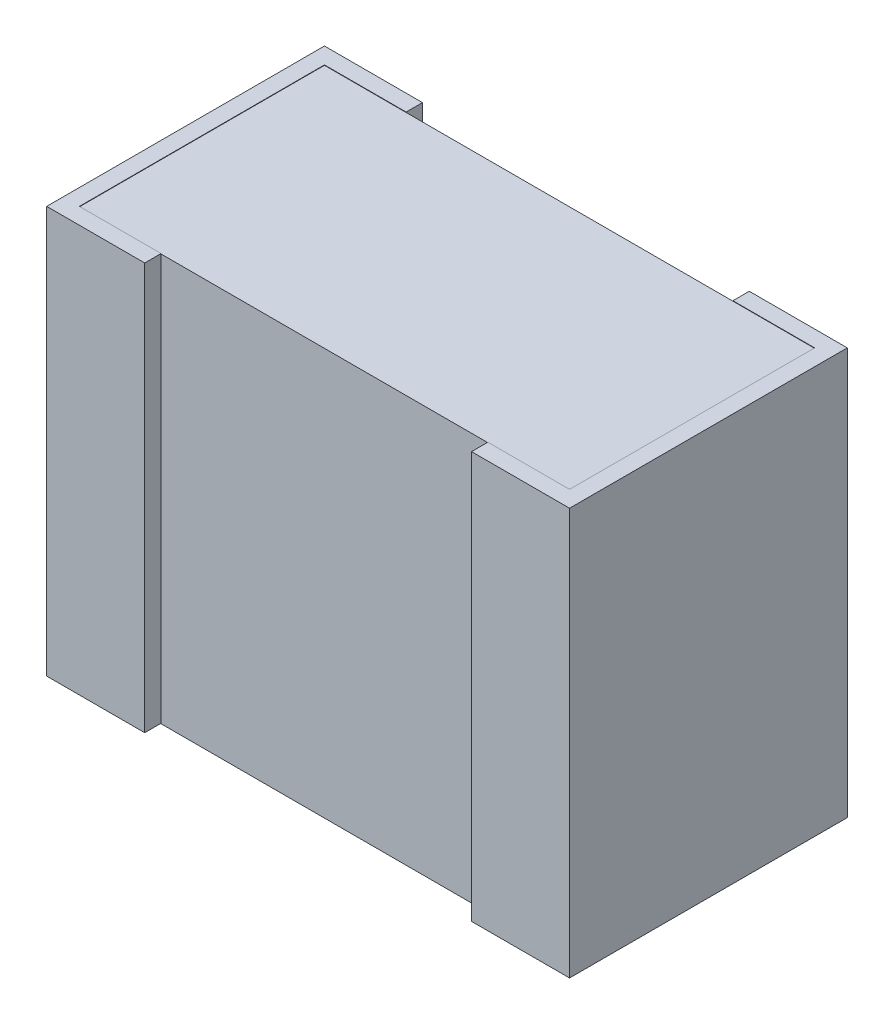
ISO-10303-21;
HEADER;
FILE_DESCRIPTION(('STEP AP214'),'2;1');
FILE_NAME('part.step','',(''),(''),'','','');
FILE_SCHEMA(('AUTOMOTIVE_DESIGN { 1 0 10303 214 1 1 1 1 }'));
ENDSEC;
DATA;
#1=APPLICATION_CONTEXT('core data for automotive mechanical design processes');
#2=APPLICATION_PROTOCOL_DEFINITION('international standard','automotive_design',2000,#1);
#3=PRODUCT_CONTEXT('',#1,'mechanical');
#4=PRODUCT('Part','Part','',(#3));
#5=PRODUCT_RELATED_PRODUCT_CATEGORY('part','',(#4));
#6=PRODUCT_DEFINITION_FORMATION('','',#4);
#7=PRODUCT_DEFINITION_CONTEXT('part definition',#1,'design');
#8=PRODUCT_DEFINITION('design','',#6,#7);
#9=PRODUCT_DEFINITION_SHAPE('','',#8);
#10=(LENGTH_UNIT() NAMED_UNIT(*) SI_UNIT(.MILLI.,.METRE.));
#11=(NAMED_UNIT(*) PLANE_ANGLE_UNIT() SI_UNIT($,.RADIAN.));
#12=(NAMED_UNIT(*) SI_UNIT($,.STERADIAN.) SOLID_ANGLE_UNIT());
#13=UNCERTAINTY_MEASURE_WITH_UNIT(LENGTH_MEASURE(1.E-05),#10,'distance_accuracy_value','');
#14=(GEOMETRIC_REPRESENTATION_CONTEXT(3) GLOBAL_UNCERTAINTY_ASSIGNED_CONTEXT((#13)) GLOBAL_UNIT_ASSIGNED_CONTEXT((#10,
#11,#12)) REPRESENTATION_CONTEXT('',''));
#15=CARTESIAN_POINT('',(0.,0.,0.));
#16=DIRECTION('',(0.,0.,1.));
#17=DIRECTION('',(1.,0.,0.));
#18=AXIS2_PLACEMENT_3D('',#15,#16,#17);
#19=CARTESIAN_POINT('',(-1.5,1.245,0.75));
#20=DIRECTION('',(0.,0.,-1.));
#21=DIRECTION('',(-1.,0.,0.));
#22=AXIS2_PLACEMENT_3D('',#19,#20,#21);
#23=PLANE('',#22);
#24=DIRECTION('',(0.,1.,0.));
#25=VECTOR('',#24,1.);
#26=CARTESIAN_POINT('',(1.,-1.24246,0.75));
#27=LINE('',#26,#25);
#28=CARTESIAN_POINT('',(1.,-1.24246,0.75));
#29=VERTEX_POINT('',#28);
#30=CARTESIAN_POINT('',(1.,1.245,0.75));
#31=VERTEX_POINT('',#30);
#32=EDGE_CURVE('E315',#29,#31,#27,.T.);
#33=ORIENTED_EDGE('',*,*,#32,.T.);
#34=DIRECTION('',(1.,0.,0.));
#35=VECTOR('',#34,1.);
#36=CARTESIAN_POINT('',(-1.5,1.245,0.75));
#37=LINE('',#36,#35);
#38=CARTESIAN_POINT('',(-1.,1.245,0.75));
#39=VERTEX_POINT('',#38);
#40=EDGE_CURVE('E224',#39,#31,#37,.T.);
#41=ORIENTED_EDGE('',*,*,#40,.F.);
#42=DIRECTION('',(0.,1.,0.));
#43=VECTOR('',#42,1.);
#44=CARTESIAN_POINT('',(-1.,-1.24246,0.75));
#45=LINE('',#44,#43);
#46=CARTESIAN_POINT('',(-1.,-1.24246,0.75));
#47=VERTEX_POINT('',#46);
#48=EDGE_CURVE('E61',#47,#39,#45,.T.);
#49=ORIENTED_EDGE('',*,*,#48,.F.);
#50=DIRECTION('',(1.,0.,0.));
#51=VECTOR('',#50,1.);
#52=CARTESIAN_POINT('',(-1.5,-1.24246,0.75));
#53=LINE('',#52,#51);
#54=CARTESIAN_POINT('',(-1.5,-1.24246,0.75));
#55=VERTEX_POINT('',#54);
#56=EDGE_CURVE('E257',#55,#47,#53,.T.);
#57=ORIENTED_EDGE('',*,*,#56,.F.);
#58=DIRECTION('',(0.,-1.,0.));
#59=VECTOR('',#58,1.);
#60=CARTESIAN_POINT('',(-1.5,1.245,0.75));
#61=LINE('',#60,#59);
#62=CARTESIAN_POINT('',(-1.5,-1.245,0.75));
#63=VERTEX_POINT('',#62);
#64=EDGE_CURVE('E11',#55,#63,#61,.T.);
#65=ORIENTED_EDGE('',*,*,#64,.T.);
#66=DIRECTION('',(1.,0.,0.));
#67=VECTOR('',#66,1.);
#68=CARTESIAN_POINT('',(-1.5,-1.245,0.75));
#69=LINE('',#68,#67);
#70=CARTESIAN_POINT('',(1.5,-1.245,0.75));
#71=VERTEX_POINT('',#70);
#72=EDGE_CURVE('E207',#63,#71,#69,.T.);
#73=ORIENTED_EDGE('',*,*,#72,.T.);
#74=DIRECTION('',(0.,-1.,0.));
#75=VECTOR('',#74,1.);
#76=CARTESIAN_POINT('',(1.5,1.245,0.75));
#77=LINE('',#76,#75);
#78=CARTESIAN_POINT('',(1.5,-1.24246,0.75));
#79=VERTEX_POINT('',#78);
#80=EDGE_CURVE('E45',#79,#71,#77,.T.);
#81=ORIENTED_EDGE('',*,*,#80,.F.);
#82=DIRECTION('',(-1.,0.,0.));
#83=VECTOR('',#82,1.);
#84=CARTESIAN_POINT('',(1.5,-1.24246,0.75));
#85=LINE('',#84,#83);
#86=EDGE_CURVE('E185',#79,#29,#85,.T.);
#87=ORIENTED_EDGE('',*,*,#86,.T.);
#88=EDGE_LOOP('',(#33,#41,#49,#57,#65,#73,#81,#87));
#89=FACE_BOUND('',#88,.T.);
#90=ADVANCED_FACE('F36',(#89),#23,.F.);
#91=CARTESIAN_POINT('',(1.5,1.245,-0.75));
#92=DIRECTION('',(1.,0.,0.));
#93=DIRECTION('',(0.,0.,-1.));
#94=AXIS2_PLACEMENT_3D('',#91,#92,#93);
#95=PLANE('',#94);
#96=DIRECTION('',(0.,-1.,0.));
#97=VECTOR('',#96,1.);
#98=CARTESIAN_POINT('',(1.5,1.245,-0.75));
#99=LINE('',#98,#97);
#100=CARTESIAN_POINT('',(1.5,-1.24246,-0.75));
#101=VERTEX_POINT('',#100);
#102=CARTESIAN_POINT('',(1.5,-1.245,-0.75));
#103=VERTEX_POINT('',#102);
#104=EDGE_CURVE('E203',#101,#103,#99,.T.);
#105=ORIENTED_EDGE('',*,*,#104,.F.);
#106=DIRECTION('',(0.,0.,1.));
#107=VECTOR('',#106,1.);
#108=CARTESIAN_POINT('',(1.5,-1.24246,-0.75));
#109=LINE('',#108,#107);
#110=EDGE_CURVE('E189',#101,#79,#109,.T.);
#111=ORIENTED_EDGE('',*,*,#110,.T.);
#112=ORIENTED_EDGE('',*,*,#80,.T.);
#113=DIRECTION('',(0.,0.,1.));
#114=VECTOR('',#113,1.);
#115=CARTESIAN_POINT('',(1.5,-1.245,-0.75));
#116=LINE('',#115,#114);
#117=EDGE_CURVE('E213',#103,#71,#116,.T.);
#118=ORIENTED_EDGE('',*,*,#117,.F.);
#119=EDGE_LOOP('',(#105,#111,#112,#118));
#120=FACE_BOUND('',#119,.T.);
#121=ADVANCED_FACE('F200',(#120),#95,.T.);
#122=CARTESIAN_POINT('',(1.5,1.245,-0.75));
#123=DIRECTION('',(0.,0.,1.));
#124=DIRECTION('',(1.,0.,0.));
#125=AXIS2_PLACEMENT_3D('',#122,#123,#124);
#126=PLANE('',#125);
#127=DIRECTION('',(0.,1.,0.));
#128=VECTOR('',#127,1.);
#129=CARTESIAN_POINT('',(1.,-1.24246,-0.75));
#130=LINE('',#129,#128);
#131=CARTESIAN_POINT('',(1.,-1.24246,-0.75));
#132=VERTEX_POINT('',#131);
#133=CARTESIAN_POINT('',(1.,1.245,-0.75));
#134=VERTEX_POINT('',#133);
#135=EDGE_CURVE('E53',#132,#134,#130,.T.);
#136=ORIENTED_EDGE('',*,*,#135,.F.);
#137=DIRECTION('',(1.,0.,0.));
#138=VECTOR('',#137,1.);
#139=CARTESIAN_POINT('',(1.,-1.24246,-0.75));
#140=LINE('',#139,#138);
#141=EDGE_CURVE('E204',#132,#101,#140,.T.);
#142=ORIENTED_EDGE('',*,*,#141,.T.);
#143=ORIENTED_EDGE('',*,*,#104,.T.);
#144=DIRECTION('',(-1.,0.,0.));
#145=VECTOR('',#144,1.);
#146=CARTESIAN_POINT('',(1.5,-1.245,-0.75));
#147=LINE('',#146,#145);
#148=CARTESIAN_POINT('',(-1.5,-1.245,-0.75));
#149=VERTEX_POINT('',#148);
#150=EDGE_CURVE('E215',#103,#149,#147,.T.);
#151=ORIENTED_EDGE('',*,*,#150,.T.);
#152=DIRECTION('',(0.,-1.,0.));
#153=VECTOR('',#152,1.);
#154=CARTESIAN_POINT('',(-1.5,1.245,-0.75));
#155=LINE('',#154,#153);
#156=CARTESIAN_POINT('',(-1.5,-1.24246,-0.75));
#157=VERTEX_POINT('',#156);
#158=EDGE_CURVE('E40',#157,#149,#155,.T.);
#159=ORIENTED_EDGE('',*,*,#158,.F.);
#160=DIRECTION('',(-1.,0.,0.));
#161=VECTOR('',#160,1.);
#162=CARTESIAN_POINT('',(-1.,-1.24246,-0.75));
#163=LINE('',#162,#161);
#164=CARTESIAN_POINT('',(-1.,-1.24246,-0.75));
#165=VERTEX_POINT('',#164);
#166=EDGE_CURVE('E282',#165,#157,#163,.T.);
#167=ORIENTED_EDGE('',*,*,#166,.F.);
#168=DIRECTION('',(0.,1.,0.));
#169=VECTOR('',#168,1.);
#170=CARTESIAN_POINT('',(-1.,-1.24246,-0.75));
#171=LINE('',#170,#169);
#172=CARTESIAN_POINT('',(-1.,1.245,-0.75));
#173=VERTEX_POINT('',#172);
#174=EDGE_CURVE('E245',#165,#173,#171,.T.);
#175=ORIENTED_EDGE('',*,*,#174,.T.);
#176=DIRECTION('',(-1.,0.,0.));
#177=VECTOR('',#176,1.);
#178=CARTESIAN_POINT('',(1.5,1.245,-0.75));
#179=LINE('',#178,#177);
#180=EDGE_CURVE('E231',#134,#173,#179,.T.);
#181=ORIENTED_EDGE('',*,*,#180,.F.);
#182=EDGE_LOOP('',(#136,#142,#143,#151,#159,#167,#175,#181));
#183=FACE_BOUND('',#182,.T.);
#184=ADVANCED_FACE('F350',(#183),#126,.F.);
#185=CARTESIAN_POINT('',(-1.5,1.245,0.75));
#186=DIRECTION('',(-1.,0.,0.));
#187=DIRECTION('',(0.,0.,1.));
#188=AXIS2_PLACEMENT_3D('',#185,#186,#187);
#189=PLANE('',#188);
#190=ORIENTED_EDGE('',*,*,#64,.F.);
#191=DIRECTION('',(0.,0.,1.));
#192=VECTOR('',#191,1.);
#193=CARTESIAN_POINT('',(-1.5,-1.24246,-0.75));
#194=LINE('',#193,#192);
#195=EDGE_CURVE('E253',#157,#55,#194,.T.);
#196=ORIENTED_EDGE('',*,*,#195,.F.);
#197=ORIENTED_EDGE('',*,*,#158,.T.);
#198=DIRECTION('',(0.,0.,-1.));
#199=VECTOR('',#198,1.);
#200=CARTESIAN_POINT('',(-1.5,-1.245,0.75));
#201=LINE('',#200,#199);
#202=EDGE_CURVE('E218',#63,#149,#201,.T.);
#203=ORIENTED_EDGE('',*,*,#202,.F.);
#204=EDGE_LOOP('',(#190,#196,#197,#203));
#205=FACE_BOUND('',#204,.T.);
#206=ADVANCED_FACE('F38',(#205),#189,.T.);
#207=CARTESIAN_POINT('',(-1.5,1.245,0.75));
#208=DIRECTION('',(0.,-1.,0.));
#209=DIRECTION('',(0.,0.,-1.));
#210=AXIS2_PLACEMENT_3D('',#207,#208,#209);
#211=PLANE('',#210);
#212=DIRECTION('',(0.,0.,-1.));
#213=VECTOR('',#212,1.);
#214=CARTESIAN_POINT('',(-1.5,1.245,0.75));
#215=LINE('',#214,#213);
#216=CARTESIAN_POINT('',(-1.5,1.245,0.75));
#217=VERTEX_POINT('',#216);
#218=CARTESIAN_POINT('',(-1.5,1.245,-0.75));
#219=VERTEX_POINT('',#218);
#220=EDGE_CURVE('E212',#217,#219,#215,.T.);
#221=ORIENTED_EDGE('',*,*,#220,.F.);
#222=EDGE_CURVE('E221',#217,#39,#37,.T.);
#223=ORIENTED_EDGE('',*,*,#222,.T.);
#224=ORIENTED_EDGE('',*,*,#40,.T.);
#225=CARTESIAN_POINT('',(1.5,1.245,0.75));
#226=VERTEX_POINT('',#225);
#227=EDGE_CURVE('E225',#31,#226,#37,.T.);
#228=ORIENTED_EDGE('',*,*,#227,.T.);
#229=DIRECTION('',(0.,0.,1.));
#230=VECTOR('',#229,1.);
#231=CARTESIAN_POINT('',(1.5,1.245,-0.75));
#232=LINE('',#231,#230);
#233=CARTESIAN_POINT('',(1.5,1.245,-0.75));
#234=VERTEX_POINT('',#233);
#235=EDGE_CURVE('E226',#234,#226,#232,.T.);
#236=ORIENTED_EDGE('',*,*,#235,.F.);
#237=EDGE_CURVE('E228',#234,#134,#179,.T.);
#238=ORIENTED_EDGE('',*,*,#237,.T.);
#239=ORIENTED_EDGE('',*,*,#180,.T.);
#240=EDGE_CURVE('E232',#173,#219,#179,.T.);
#241=ORIENTED_EDGE('',*,*,#240,.T.);
#242=EDGE_LOOP('',(#221,#223,#224,#228,#236,#238,#239,#241));
#243=FACE_BOUND('',#242,.T.);
#244=ADVANCED_FACE('F377',(#243),#211,.F.);
#245=CARTESIAN_POINT('',(-1.5,-1.245,0.75));
#246=DIRECTION('',(0.,-1.,0.));
#247=DIRECTION('',(0.,0.,-1.));
#248=AXIS2_PLACEMENT_3D('',#245,#246,#247);
#249=PLANE('',#248);
#250=ORIENTED_EDGE('',*,*,#202,.T.);
#251=ORIENTED_EDGE('',*,*,#150,.F.);
#252=ORIENTED_EDGE('',*,*,#117,.T.);
#253=ORIENTED_EDGE('',*,*,#72,.F.);
#254=EDGE_LOOP('',(#250,#251,#252,#253));
#255=FACE_BOUND('',#254,.T.);
#256=ADVANCED_FACE('F446',(#255),#249,.T.);
#257=CARTESIAN_POINT('',(-1.5,-1.24246,0.75));
#258=DIRECTION('',(0.,0.,1.));
#259=DIRECTION('',(1.,0.,0.));
#260=AXIS2_PLACEMENT_3D('',#257,#258,#259);
#261=PLANE('',#260);
#262=CARTESIAN_POINT('',(-1.,1.24754,0.75));
#263=VERTEX_POINT('',#262);
#264=EDGE_CURVE('E236',#39,#263,#45,.T.);
#265=ORIENTED_EDGE('',*,*,#264,.F.);
#266=ORIENTED_EDGE('',*,*,#222,.F.);
#267=DIRECTION('',(0.,1.,0.));
#268=VECTOR('',#267,1.);
#269=CARTESIAN_POINT('',(-1.5,-1.24246,0.75));
#270=LINE('',#269,#268);
#271=CARTESIAN_POINT('',(-1.5,1.24754,0.75));
#272=VERTEX_POINT('',#271);
#273=EDGE_CURVE('E251',#217,#272,#270,.T.);
#274=ORIENTED_EDGE('',*,*,#273,.T.);
#275=DIRECTION('',(1.,0.,0.));
#276=VECTOR('',#275,1.);
#277=CARTESIAN_POINT('',(-1.5,1.24754,0.75));
#278=LINE('',#277,#276);
#279=EDGE_CURVE('E276',#272,#263,#278,.T.);
#280=ORIENTED_EDGE('',*,*,#279,.T.);
#281=EDGE_LOOP('',(#265,#266,#274,#280));
#282=FACE_BOUND('',#281,.T.);
#283=ADVANCED_FACE('F383',(#282),#261,.F.);
#284=CARTESIAN_POINT('',(-1.,-1.24246,-0.75));
#285=DIRECTION('',(0.,0.,-1.));
#286=DIRECTION('',(-1.,0.,0.));
#287=AXIS2_PLACEMENT_3D('',#284,#285,#286);
#288=PLANE('',#287);
#289=DIRECTION('',(0.,1.,0.));
#290=VECTOR('',#289,1.);
#291=CARTESIAN_POINT('',(-1.5,-1.24246,-0.75));
#292=LINE('',#291,#290);
#293=CARTESIAN_POINT('',(-1.5,1.24754,-0.75));
#294=VERTEX_POINT('',#293);
#295=EDGE_CURVE('E249',#219,#294,#292,.T.);
#296=ORIENTED_EDGE('',*,*,#295,.F.);
#297=ORIENTED_EDGE('',*,*,#240,.F.);
#298=CARTESIAN_POINT('',(-1.,1.24754,-0.75));
#299=VERTEX_POINT('',#298);
#300=EDGE_CURVE('E248',#173,#299,#171,.T.);
#301=ORIENTED_EDGE('',*,*,#300,.T.);
#302=DIRECTION('',(-1.,0.,0.));
#303=VECTOR('',#302,1.);
#304=CARTESIAN_POINT('',(-1.,1.24754,-0.75));
#305=LINE('',#304,#303);
#306=EDGE_CURVE('E258',#299,#294,#305,.T.);
#307=ORIENTED_EDGE('',*,*,#306,.T.);
#308=EDGE_LOOP('',(#296,#297,#301,#307));
#309=FACE_BOUND('',#308,.T.);
#310=ADVANCED_FACE('F413',(#309),#288,.F.);
#311=CARTESIAN_POINT('',(-1.5,-1.24246,-0.75));
#312=DIRECTION('',(-1.,0.,0.));
#313=DIRECTION('',(0.,0.,1.));
#314=AXIS2_PLACEMENT_3D('',#311,#312,#313);
#315=PLANE('',#314);
#316=ORIENTED_EDGE('',*,*,#273,.F.);
#317=ORIENTED_EDGE('',*,*,#220,.T.);
#318=ORIENTED_EDGE('',*,*,#295,.T.);
#319=DIRECTION('',(0.,0.,1.));
#320=VECTOR('',#319,1.);
#321=CARTESIAN_POINT('',(-1.5,1.24754,-0.75));
#322=LINE('',#321,#320);
#323=EDGE_CURVE('E254',#294,#272,#322,.T.);
#324=ORIENTED_EDGE('',*,*,#323,.T.);
#325=EDGE_LOOP('',(#316,#317,#318,#324));
#326=FACE_BOUND('',#325,.T.);
#327=ADVANCED_FACE('F467',(#326),#315,.F.);
#328=CARTESIAN_POINT('',(-1.,-1.24246,0.85));
#329=DIRECTION('',(1.,0.,0.));
#330=DIRECTION('',(0.,0.,-1.));
#331=AXIS2_PLACEMENT_3D('',#328,#329,#330);
#332=PLANE('',#331);
#333=DIRECTION('',(0.,0.,-1.));
#334=VECTOR('',#333,1.);
#335=CARTESIAN_POINT('',(-1.,1.24754,0.85));
#336=LINE('',#335,#334);
#337=CARTESIAN_POINT('',(-1.,1.24754,0.85));
#338=VERTEX_POINT('',#337);
#339=EDGE_CURVE('E273',#338,#263,#336,.T.);
#340=ORIENTED_EDGE('',*,*,#339,.F.);
#341=DIRECTION('',(0.,1.,0.));
#342=VECTOR('',#341,1.);
#343=CARTESIAN_POINT('',(-1.,-1.24246,0.85));
#344=LINE('',#343,#342);
#345=CARTESIAN_POINT('',(-1.,-1.24246,0.85));
#346=VERTEX_POINT('',#345);
#347=EDGE_CURVE('E237',#346,#338,#344,.T.);
#348=ORIENTED_EDGE('',*,*,#347,.F.);
#349=DIRECTION('',(0.,0.,-1.));
#350=VECTOR('',#349,1.);
#351=CARTESIAN_POINT('',(-1.,-1.24246,0.85));
#352=LINE('',#351,#350);
#353=EDGE_CURVE('E296',#346,#47,#352,.T.);
#354=ORIENTED_EDGE('',*,*,#353,.T.);
#355=ORIENTED_EDGE('',*,*,#48,.T.);
#356=ORIENTED_EDGE('',*,*,#264,.T.);
#357=EDGE_LOOP('',(#340,#348,#354,#355,#356));
#358=FACE_BOUND('',#357,.T.);
#359=ADVANCED_FACE('F387',(#358),#332,.T.);
#360=CARTESIAN_POINT('',(-1.6,-1.24246,0.85));
#361=DIRECTION('',(0.,0.,1.));
#362=DIRECTION('',(1.,0.,0.));
#363=AXIS2_PLACEMENT_3D('',#360,#361,#362);
#364=PLANE('',#363);
#365=DIRECTION('',(1.,0.,0.));
#366=VECTOR('',#365,1.);
#367=CARTESIAN_POINT('',(-1.6,1.24754,0.85));
#368=LINE('',#367,#366);
#369=CARTESIAN_POINT('',(-1.6,1.24754,0.85));
#370=VERTEX_POINT('',#369);
#371=EDGE_CURVE('E270',#370,#338,#368,.T.);
#372=ORIENTED_EDGE('',*,*,#371,.F.);
#373=DIRECTION('',(0.,1.,0.));
#374=VECTOR('',#373,1.);
#375=CARTESIAN_POINT('',(-1.6,-1.24246,0.85));
#376=LINE('',#375,#374);
#377=CARTESIAN_POINT('',(-1.6,-1.24246,0.85));
#378=VERTEX_POINT('',#377);
#379=EDGE_CURVE('E239',#378,#370,#376,.T.);
#380=ORIENTED_EDGE('',*,*,#379,.F.);
#381=DIRECTION('',(1.,0.,0.));
#382=VECTOR('',#381,1.);
#383=CARTESIAN_POINT('',(-1.6,-1.24246,0.85));
#384=LINE('',#383,#382);
#385=EDGE_CURVE('E293',#378,#346,#384,.T.);
#386=ORIENTED_EDGE('',*,*,#385,.T.);
#387=ORIENTED_EDGE('',*,*,#347,.T.);
#388=EDGE_LOOP('',(#372,#380,#386,#387));
#389=FACE_BOUND('',#388,.T.);
#390=ADVANCED_FACE('F394',(#389),#364,.T.);
#391=CARTESIAN_POINT('',(-1.6,-1.24246,0.85));
#392=DIRECTION('',(1.,0.,0.));
#393=DIRECTION('',(0.,0.,-1.));
#394=AXIS2_PLACEMENT_3D('',#391,#392,#393);
#395=PLANE('',#394);
#396=DIRECTION('',(0.,0.,-1.));
#397=VECTOR('',#396,1.);
#398=CARTESIAN_POINT('',(-1.6,1.24754,0.85));
#399=LINE('',#398,#397);
#400=CARTESIAN_POINT('',(-1.6,1.24754,-0.85));
#401=VERTEX_POINT('',#400);
#402=EDGE_CURVE('E267',#370,#401,#399,.T.);
#403=ORIENTED_EDGE('',*,*,#402,.T.);
#404=DIRECTION('',(0.,1.,0.));
#405=VECTOR('',#404,1.);
#406=CARTESIAN_POINT('',(-1.6,-1.24246,-0.85));
#407=LINE('',#406,#405);
#408=CARTESIAN_POINT('',(-1.6,-1.24246,-0.85));
#409=VERTEX_POINT('',#408);
#410=EDGE_CURVE('E241',#409,#401,#407,.T.);
#411=ORIENTED_EDGE('',*,*,#410,.F.);
#412=DIRECTION('',(0.,0.,-1.));
#413=VECTOR('',#412,1.);
#414=CARTESIAN_POINT('',(-1.6,-1.24246,0.85));
#415=LINE('',#414,#413);
#416=EDGE_CURVE('E291',#378,#409,#415,.T.);
#417=ORIENTED_EDGE('',*,*,#416,.F.);
#418=ORIENTED_EDGE('',*,*,#379,.T.);
#419=EDGE_LOOP('',(#403,#411,#417,#418));
#420=FACE_BOUND('',#419,.T.);
#421=ADVANCED_FACE('F399',(#420),#395,.F.);
#422=CARTESIAN_POINT('',(-1.,-1.24246,-0.85));
#423=DIRECTION('',(0.,0.,-1.));
#424=DIRECTION('',(-1.,0.,0.));
#425=AXIS2_PLACEMENT_3D('',#422,#423,#424);
#426=PLANE('',#425);
#427=DIRECTION('',(-1.,0.,0.));
#428=VECTOR('',#427,1.);
#429=CARTESIAN_POINT('',(-1.,1.24754,-0.85));
#430=LINE('',#429,#428);
#431=CARTESIAN_POINT('',(-1.,1.24754,-0.85));
#432=VERTEX_POINT('',#431);
#433=EDGE_CURVE('E264',#432,#401,#430,.T.);
#434=ORIENTED_EDGE('',*,*,#433,.F.);
#435=DIRECTION('',(0.,1.,0.));
#436=VECTOR('',#435,1.);
#437=CARTESIAN_POINT('',(-1.,-1.24246,-0.85));
#438=LINE('',#437,#436);
#439=CARTESIAN_POINT('',(-1.,-1.24246,-0.85));
#440=VERTEX_POINT('',#439);
#441=EDGE_CURVE('E243',#440,#432,#438,.T.);
#442=ORIENTED_EDGE('',*,*,#441,.F.);
#443=DIRECTION('',(-1.,0.,0.));
#444=VECTOR('',#443,1.);
#445=CARTESIAN_POINT('',(-1.,-1.24246,-0.85));
#446=LINE('',#445,#444);
#447=EDGE_CURVE('E288',#440,#409,#446,.T.);
#448=ORIENTED_EDGE('',*,*,#447,.T.);
#449=ORIENTED_EDGE('',*,*,#410,.T.);
#450=EDGE_LOOP('',(#434,#442,#448,#449));
#451=FACE_BOUND('',#450,.T.);
#452=ADVANCED_FACE('F476',(#451),#426,.T.);
#453=CARTESIAN_POINT('',(-1.,-1.24246,-0.75));
#454=DIRECTION('',(1.,0.,0.));
#455=DIRECTION('',(0.,0.,-1.));
#456=AXIS2_PLACEMENT_3D('',#453,#454,#455);
#457=PLANE('',#456);
#458=DIRECTION('',(0.,0.,-1.));
#459=VECTOR('',#458,1.);
#460=CARTESIAN_POINT('',(-1.,1.24754,-0.75));
#461=LINE('',#460,#459);
#462=EDGE_CURVE('E261',#299,#432,#461,.T.);
#463=ORIENTED_EDGE('',*,*,#462,.F.);
#464=ORIENTED_EDGE('',*,*,#300,.F.);
#465=ORIENTED_EDGE('',*,*,#174,.F.);
#466=DIRECTION('',(0.,0.,-1.));
#467=VECTOR('',#466,1.);
#468=CARTESIAN_POINT('',(-1.,-1.24246,-0.75));
#469=LINE('',#468,#467);
#470=EDGE_CURVE('E285',#165,#440,#469,.T.);
#471=ORIENTED_EDGE('',*,*,#470,.T.);
#472=ORIENTED_EDGE('',*,*,#441,.T.);
#473=EDGE_LOOP('',(#463,#464,#465,#471,#472));
#474=FACE_BOUND('',#473,.T.);
#475=ADVANCED_FACE('F406',(#474),#457,.T.);
#476=CARTESIAN_POINT('',(-1.6,-1.24246,0.75));
#477=DIRECTION('',(0.,1.,0.));
#478=DIRECTION('',(0.,0.,1.));
#479=AXIS2_PLACEMENT_3D('',#476,#477,#478);
#480=PLANE('',#479);
#481=ORIENTED_EDGE('',*,*,#56,.T.);
#482=ORIENTED_EDGE('',*,*,#353,.F.);
#483=ORIENTED_EDGE('',*,*,#385,.F.);
#484=ORIENTED_EDGE('',*,*,#416,.T.);
#485=ORIENTED_EDGE('',*,*,#447,.F.);
#486=ORIENTED_EDGE('',*,*,#470,.F.);
#487=ORIENTED_EDGE('',*,*,#166,.T.);
#488=ORIENTED_EDGE('',*,*,#195,.T.);
#489=EDGE_LOOP('',(#481,#482,#483,#484,#485,#486,#487,#488));
#490=FACE_BOUND('',#489,.T.);
#491=ADVANCED_FACE('F391',(#490),#480,.F.);
#492=CARTESIAN_POINT('',(-1.6,1.24754,0.75));
#493=DIRECTION('',(0.,1.,0.));
#494=DIRECTION('',(0.,0.,1.));
#495=AXIS2_PLACEMENT_3D('',#492,#493,#494);
#496=PLANE('',#495);
#497=ORIENTED_EDGE('',*,*,#279,.F.);
#498=ORIENTED_EDGE('',*,*,#323,.F.);
#499=ORIENTED_EDGE('',*,*,#306,.F.);
#500=ORIENTED_EDGE('',*,*,#462,.T.);
#501=ORIENTED_EDGE('',*,*,#433,.T.);
#502=ORIENTED_EDGE('',*,*,#402,.F.);
#503=ORIENTED_EDGE('',*,*,#371,.T.);
#504=ORIENTED_EDGE('',*,*,#339,.T.);
#505=EDGE_LOOP('',(#497,#498,#499,#500,#501,#502,#503,#504));
#506=FACE_BOUND('',#505,.T.);
#507=ADVANCED_FACE('F429',(#506),#496,.T.);
#508=CARTESIAN_POINT('',(1.5,-1.24246,0.75));
#509=DIRECTION('',(0.,0.,-1.));
#510=DIRECTION('',(-1.,0.,0.));
#511=AXIS2_PLACEMENT_3D('',#508,#509,#510);
#512=PLANE('',#511);
#513=ORIENTED_EDGE('',*,*,#227,.F.);
#514=CARTESIAN_POINT('',(1.,1.24754,0.75));
#515=VERTEX_POINT('',#514);
#516=EDGE_CURVE('E317',#31,#515,#27,.T.);
#517=ORIENTED_EDGE('',*,*,#516,.T.);
#518=DIRECTION('',(-1.,0.,0.));
#519=VECTOR('',#518,1.);
#520=CARTESIAN_POINT('',(1.5,1.24754,0.75));
#521=LINE('',#520,#519);
#522=CARTESIAN_POINT('',(1.5,1.24754,0.75));
#523=VERTEX_POINT('',#522);
#524=EDGE_CURVE('E336',#523,#515,#521,.T.);
#525=ORIENTED_EDGE('',*,*,#524,.F.);
#526=DIRECTION('',(0.,1.,0.));
#527=VECTOR('',#526,1.);
#528=CARTESIAN_POINT('',(1.5,-1.24246,0.75));
#529=LINE('',#528,#527);
#530=EDGE_CURVE('E279',#226,#523,#529,.T.);
#531=ORIENTED_EDGE('',*,*,#530,.F.);
#532=EDGE_LOOP('',(#513,#517,#525,#531));
#533=FACE_BOUND('',#532,.T.);
#534=ADVANCED_FACE('F427',(#533),#512,.T.);
#535=CARTESIAN_POINT('',(1.5,-1.24246,-0.75));
#536=DIRECTION('',(-1.,0.,0.));
#537=DIRECTION('',(0.,0.,1.));
#538=AXIS2_PLACEMENT_3D('',#535,#536,#537);
#539=PLANE('',#538);
#540=ORIENTED_EDGE('',*,*,#235,.T.);
#541=ORIENTED_EDGE('',*,*,#530,.T.);
#542=DIRECTION('',(0.,0.,1.));
#543=VECTOR('',#542,1.);
#544=CARTESIAN_POINT('',(1.5,1.24754,-0.75));
#545=LINE('',#544,#543);
#546=CARTESIAN_POINT('',(1.5,1.24754,-0.75));
#547=VERTEX_POINT('',#546);
#548=EDGE_CURVE('E333',#547,#523,#545,.T.);
#549=ORIENTED_EDGE('',*,*,#548,.F.);
#550=DIRECTION('',(0.,1.,0.));
#551=VECTOR('',#550,1.);
#552=CARTESIAN_POINT('',(1.5,-1.24246,-0.75));
#553=LINE('',#552,#551);
#554=EDGE_CURVE('E301',#234,#547,#553,.T.);
#555=ORIENTED_EDGE('',*,*,#554,.F.);
#556=EDGE_LOOP('',(#540,#541,#549,#555));
#557=FACE_BOUND('',#556,.T.);
#558=ADVANCED_FACE('F421',(#557),#539,.T.);
#559=CARTESIAN_POINT('',(1.,-1.24246,-0.75));
#560=DIRECTION('',(0.,0.,1.));
#561=DIRECTION('',(1.,0.,0.));
#562=AXIS2_PLACEMENT_3D('',#559,#560,#561);
#563=PLANE('',#562);
#564=ORIENTED_EDGE('',*,*,#237,.F.);
#565=ORIENTED_EDGE('',*,*,#554,.T.);
#566=DIRECTION('',(1.,0.,0.));
#567=VECTOR('',#566,1.);
#568=CARTESIAN_POINT('',(1.,1.24754,-0.75));
#569=LINE('',#568,#567);
#570=CARTESIAN_POINT('',(1.,1.24754,-0.75));
#571=VERTEX_POINT('',#570);
#572=EDGE_CURVE('E330',#571,#547,#569,.T.);
#573=ORIENTED_EDGE('',*,*,#572,.F.);
#574=EDGE_CURVE('E304',#134,#571,#130,.T.);
#575=ORIENTED_EDGE('',*,*,#574,.F.);
#576=EDGE_LOOP('',(#564,#565,#573,#575));
#577=FACE_BOUND('',#576,.T.);
#578=ADVANCED_FACE('F417',(#577),#563,.T.);
#579=CARTESIAN_POINT('',(1.,-1.24246,-0.75));
#580=DIRECTION('',(1.,0.,0.));
#581=DIRECTION('',(0.,0.,-1.));
#582=AXIS2_PLACEMENT_3D('',#579,#580,#581);
#583=PLANE('',#582);
#584=DIRECTION('',(0.,0.,-1.));
#585=VECTOR('',#584,1.);
#586=CARTESIAN_POINT('',(1.,1.24754,-0.75));
#587=LINE('',#586,#585);
#588=CARTESIAN_POINT('',(1.,1.24754,-0.85));
#589=VERTEX_POINT('',#588);
#590=EDGE_CURVE('E328',#571,#589,#587,.T.);
#591=ORIENTED_EDGE('',*,*,#590,.T.);
#592=DIRECTION('',(0.,1.,0.));
#593=VECTOR('',#592,1.);
#594=CARTESIAN_POINT('',(1.,-1.24246,-0.85));
#595=LINE('',#594,#593);
#596=CARTESIAN_POINT('',(1.,-1.24246,-0.85));
#597=VERTEX_POINT('',#596);
#598=EDGE_CURVE('E305',#597,#589,#595,.T.);
#599=ORIENTED_EDGE('',*,*,#598,.F.);
#600=DIRECTION('',(0.,0.,-1.));
#601=VECTOR('',#600,1.);
#602=CARTESIAN_POINT('',(1.,-1.24246,-0.75));
#603=LINE('',#602,#601);
#604=EDGE_CURVE('E347',#132,#597,#603,.T.);
#605=ORIENTED_EDGE('',*,*,#604,.F.);
#606=ORIENTED_EDGE('',*,*,#135,.T.);
#607=ORIENTED_EDGE('',*,*,#574,.T.);
#608=EDGE_LOOP('',(#591,#599,#605,#606,#607));
#609=FACE_BOUND('',#608,.T.);
#610=ADVANCED_FACE('F357',(#609),#583,.F.);
#611=CARTESIAN_POINT('',(1.,-1.24246,-0.85));
#612=DIRECTION('',(0.,0.,1.));
#613=DIRECTION('',(1.,0.,0.));
#614=AXIS2_PLACEMENT_3D('',#611,#612,#613);
#615=PLANE('',#614);
#616=DIRECTION('',(1.,0.,0.));
#617=VECTOR('',#616,1.);
#618=CARTESIAN_POINT('',(1.,1.24754,-0.85));
#619=LINE('',#618,#617);
#620=CARTESIAN_POINT('',(1.6,1.24754,-0.85));
#621=VERTEX_POINT('',#620);
#622=EDGE_CURVE('E325',#589,#621,#619,.T.);
#623=ORIENTED_EDGE('',*,*,#622,.T.);
#624=DIRECTION('',(0.,1.,0.));
#625=VECTOR('',#624,1.);
#626=CARTESIAN_POINT('',(1.6,-1.24246,-0.85));
#627=LINE('',#626,#625);
#628=CARTESIAN_POINT('',(1.6,-1.24246,-0.85));
#629=VERTEX_POINT('',#628);
#630=EDGE_CURVE('E308',#629,#621,#627,.T.);
#631=ORIENTED_EDGE('',*,*,#630,.F.);
#632=DIRECTION('',(1.,0.,0.));
#633=VECTOR('',#632,1.);
#634=CARTESIAN_POINT('',(1.,-1.24246,-0.85));
#635=LINE('',#634,#633);
#636=EDGE_CURVE('E345',#597,#629,#635,.T.);
#637=ORIENTED_EDGE('',*,*,#636,.F.);
#638=ORIENTED_EDGE('',*,*,#598,.T.);
#639=EDGE_LOOP('',(#623,#631,#637,#638));
#640=FACE_BOUND('',#639,.T.);
#641=ADVANCED_FACE('F361',(#640),#615,.F.);
#642=CARTESIAN_POINT('',(1.6,-1.24246,0.85));
#643=DIRECTION('',(1.,0.,0.));
#644=DIRECTION('',(0.,0.,-1.));
#645=AXIS2_PLACEMENT_3D('',#642,#643,#644);
#646=PLANE('',#645);
#647=DIRECTION('',(0.,0.,-1.));
#648=VECTOR('',#647,1.);
#649=CARTESIAN_POINT('',(1.6,1.24754,0.85));
#650=LINE('',#649,#648);
#651=CARTESIAN_POINT('',(1.6,1.24754,0.85));
#652=VERTEX_POINT('',#651);
#653=EDGE_CURVE('E322',#652,#621,#650,.T.);
#654=ORIENTED_EDGE('',*,*,#653,.F.);
#655=DIRECTION('',(0.,1.,0.));
#656=VECTOR('',#655,1.);
#657=CARTESIAN_POINT('',(1.6,-1.24246,0.85));
#658=LINE('',#657,#656);
#659=CARTESIAN_POINT('',(1.6,-1.24246,0.85));
#660=VERTEX_POINT('',#659);
#661=EDGE_CURVE('E310',#660,#652,#658,.T.);
#662=ORIENTED_EDGE('',*,*,#661,.F.);
#663=DIRECTION('',(0.,0.,-1.));
#664=VECTOR('',#663,1.);
#665=CARTESIAN_POINT('',(1.6,-1.24246,0.85));
#666=LINE('',#665,#664);
#667=EDGE_CURVE('E342',#660,#629,#666,.T.);
#668=ORIENTED_EDGE('',*,*,#667,.T.);
#669=ORIENTED_EDGE('',*,*,#630,.T.);
#670=EDGE_LOOP('',(#654,#662,#668,#669));
#671=FACE_BOUND('',#670,.T.);
#672=ADVANCED_FACE('F364',(#671),#646,.T.);
#673=CARTESIAN_POINT('',(1.6,-1.24246,0.85));
#674=DIRECTION('',(0.,0.,-1.));
#675=DIRECTION('',(-1.,0.,0.));
#676=AXIS2_PLACEMENT_3D('',#673,#674,#675);
#677=PLANE('',#676);
#678=DIRECTION('',(-1.,0.,0.));
#679=VECTOR('',#678,1.);
#680=CARTESIAN_POINT('',(1.6,1.24754,0.85));
#681=LINE('',#680,#679);
#682=CARTESIAN_POINT('',(1.,1.24754,0.85));
#683=VERTEX_POINT('',#682);
#684=EDGE_CURVE('E320',#652,#683,#681,.T.);
#685=ORIENTED_EDGE('',*,*,#684,.T.);
#686=DIRECTION('',(0.,1.,0.));
#687=VECTOR('',#686,1.);
#688=CARTESIAN_POINT('',(1.,-1.24246,0.85));
#689=LINE('',#688,#687);
#690=CARTESIAN_POINT('',(1.,-1.24246,0.85));
#691=VERTEX_POINT('',#690);
#692=EDGE_CURVE('E312',#691,#683,#689,.T.);
#693=ORIENTED_EDGE('',*,*,#692,.F.);
#694=DIRECTION('',(-1.,0.,0.));
#695=VECTOR('',#694,1.);
#696=CARTESIAN_POINT('',(1.6,-1.24246,0.85));
#697=LINE('',#696,#695);
#698=EDGE_CURVE('E340',#660,#691,#697,.T.);
#699=ORIENTED_EDGE('',*,*,#698,.F.);
#700=ORIENTED_EDGE('',*,*,#661,.T.);
#701=EDGE_LOOP('',(#685,#693,#699,#700));
#702=FACE_BOUND('',#701,.T.);
#703=ADVANCED_FACE('F368',(#702),#677,.F.);
#704=CARTESIAN_POINT('',(1.,-1.24246,0.85));
#705=DIRECTION('',(1.,0.,0.));
#706=DIRECTION('',(0.,0.,-1.));
#707=AXIS2_PLACEMENT_3D('',#704,#705,#706);
#708=PLANE('',#707);
#709=DIRECTION('',(0.,0.,-1.));
#710=VECTOR('',#709,1.);
#711=CARTESIAN_POINT('',(1.,1.24754,0.85));
#712=LINE('',#711,#710);
#713=EDGE_CURVE('E196',#683,#515,#712,.T.);
#714=ORIENTED_EDGE('',*,*,#713,.T.);
#715=ORIENTED_EDGE('',*,*,#516,.F.);
#716=ORIENTED_EDGE('',*,*,#32,.F.);
#717=DIRECTION('',(0.,0.,-1.));
#718=VECTOR('',#717,1.);
#719=CARTESIAN_POINT('',(1.,-1.24246,0.85));
#720=LINE('',#719,#718);
#721=EDGE_CURVE('E192',#691,#29,#720,.T.);
#722=ORIENTED_EDGE('',*,*,#721,.F.);
#723=ORIENTED_EDGE('',*,*,#692,.T.);
#724=EDGE_LOOP('',(#714,#715,#716,#722,#723));
#725=FACE_BOUND('',#724,.T.);
#726=ADVANCED_FACE('F372',(#725),#708,.F.);
#727=CARTESIAN_POINT('',(1.6,-1.24246,0.75));
#728=DIRECTION('',(0.,1.,0.));
#729=DIRECTION('',(0.,0.,1.));
#730=AXIS2_PLACEMENT_3D('',#727,#728,#729);
#731=PLANE('',#730);
#732=ORIENTED_EDGE('',*,*,#86,.F.);
#733=ORIENTED_EDGE('',*,*,#110,.F.);
#734=ORIENTED_EDGE('',*,*,#141,.F.);
#735=ORIENTED_EDGE('',*,*,#604,.T.);
#736=ORIENTED_EDGE('',*,*,#636,.T.);
#737=ORIENTED_EDGE('',*,*,#667,.F.);
#738=ORIENTED_EDGE('',*,*,#698,.T.);
#739=ORIENTED_EDGE('',*,*,#721,.T.);
#740=EDGE_LOOP('',(#732,#733,#734,#735,#736,#737,#738,#739));
#741=FACE_BOUND('',#740,.T.);
#742=ADVANCED_FACE('F187',(#741),#731,.F.);
#743=CARTESIAN_POINT('',(1.6,1.24754,0.75));
#744=DIRECTION('',(0.,1.,0.));
#745=DIRECTION('',(0.,0.,1.));
#746=AXIS2_PLACEMENT_3D('',#743,#744,#745);
#747=PLANE('',#746);
#748=ORIENTED_EDGE('',*,*,#524,.T.);
#749=ORIENTED_EDGE('',*,*,#713,.F.);
#750=ORIENTED_EDGE('',*,*,#684,.F.);
#751=ORIENTED_EDGE('',*,*,#653,.T.);
#752=ORIENTED_EDGE('',*,*,#622,.F.);
#753=ORIENTED_EDGE('',*,*,#590,.F.);
#754=ORIENTED_EDGE('',*,*,#572,.T.);
#755=ORIENTED_EDGE('',*,*,#548,.T.);
#756=EDGE_LOOP('',(#748,#749,#750,#751,#752,#753,#754,#755));
#757=FACE_BOUND('',#756,.T.);
#758=ADVANCED_FACE('F425',(#757),#747,.T.);
#759=CLOSED_SHELL('',(#90,#121,#184,#206,#244,#256,#283,#310,#327,#359,#390,#421,#452,#475,#491,
#507,#534,#558,#578,#610,#641,#672,#703,#726,#742,#758));
#760=MANIFOLD_SOLID_BREP('B2',#759);
#761=ADVANCED_BREP_SHAPE_REPRESENTATION('',(#18,#760),#14);
#762=SHAPE_DEFINITION_REPRESENTATION(#9,#761);
ENDSEC;
END-ISO-10303-21;
